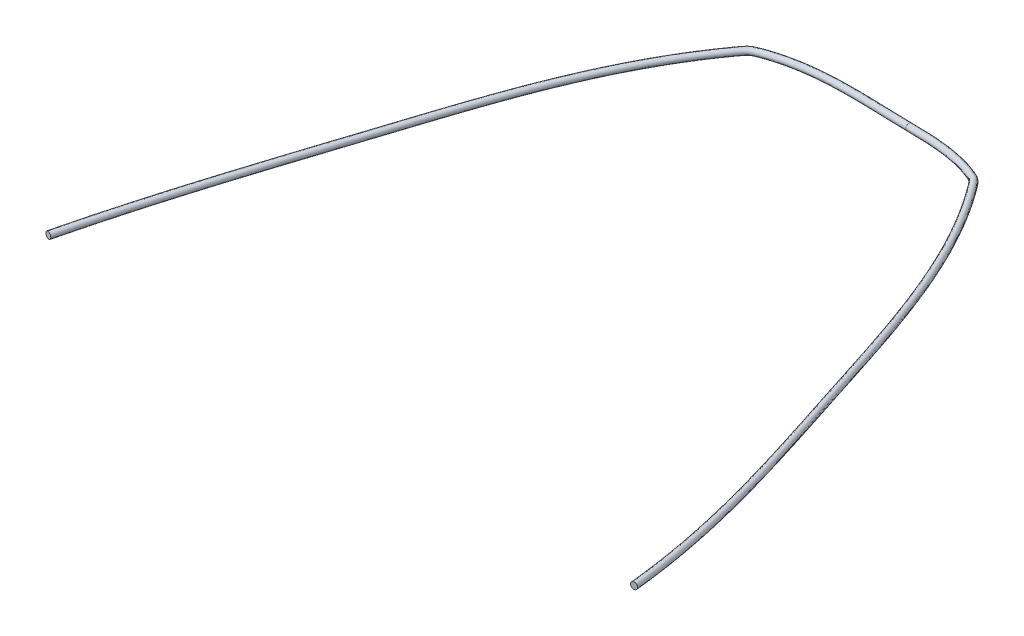
ISO-10303-21;
HEADER;
FILE_DESCRIPTION(('STEP AP214'),'2;1');
FILE_NAME('part.step','',(''),(''),'','','');
FILE_SCHEMA(('AUTOMOTIVE_DESIGN { 1 0 10303 214 1 1 1 1 }'));
ENDSEC;
DATA;
#1=APPLICATION_CONTEXT('core data for automotive mechanical design processes');
#2=APPLICATION_PROTOCOL_DEFINITION('international standard','automotive_design',2000,#1);
#3=PRODUCT_CONTEXT('',#1,'mechanical');
#4=PRODUCT('Part','Part','',(#3));
#5=PRODUCT_RELATED_PRODUCT_CATEGORY('part','',(#4));
#6=PRODUCT_DEFINITION_FORMATION('','',#4);
#7=PRODUCT_DEFINITION_CONTEXT('part definition',#1,'design');
#8=PRODUCT_DEFINITION('design','',#6,#7);
#9=PRODUCT_DEFINITION_SHAPE('','',#8);
#10=(LENGTH_UNIT() NAMED_UNIT(*) SI_UNIT(.MILLI.,.METRE.));
#11=(NAMED_UNIT(*) PLANE_ANGLE_UNIT() SI_UNIT($,.RADIAN.));
#12=(NAMED_UNIT(*) SI_UNIT($,.STERADIAN.) SOLID_ANGLE_UNIT());
#13=UNCERTAINTY_MEASURE_WITH_UNIT(LENGTH_MEASURE(1.E-05),#10,'distance_accuracy_value','');
#14=(GEOMETRIC_REPRESENTATION_CONTEXT(3) GLOBAL_UNCERTAINTY_ASSIGNED_CONTEXT((#13)) GLOBAL_UNIT_ASSIGNED_CONTEXT((#10,
#11,#12)) REPRESENTATION_CONTEXT('',''));
#15=CARTESIAN_POINT('',(0.,0.,0.));
#16=DIRECTION('',(0.,0.,1.));
#17=DIRECTION('',(1.,0.,0.));
#18=AXIS2_PLACEMENT_3D('',#15,#16,#17);
#19=CARTESIAN_POINT('',(23.9109903196537,20.5189491781118,-56.2404113987804));
#20=DIRECTION('',(-0.999920794462454,0.,-0.0125858969316691));
#21=DIRECTION('',(-0.0125858969316691,0.,0.999920794462454));
#22=AXIS2_PLACEMENT_3D('',#19,#20,#21);
#23=PLANE('',#22);
#24=CARTESIAN_POINT('',(23.9109903196537,20.5189491781118,-56.2404113987804));
#25=DIRECTION('',(-0.999920794462454,0.,-0.0125858969316691));
#26=DIRECTION('',(-0.0125858969316691,0.,0.999920794462454));
#27=AXIS2_PLACEMENT_3D('',#24,#25,#26);
#28=CIRCLE('',#27,0.500000000000001);
#29=CARTESIAN_POINT('',(23.9046973711879,20.5189491781118,-55.7404510015492));
#30=VERTEX_POINT('',#29);
#31=EDGE_CURVE('E62',#30,#30,#28,.T.);
#32=ORIENTED_EDGE('',*,*,#31,.F.);
#33=EDGE_LOOP('',(#32));
#34=FACE_BOUND('',#33,.T.);
#35=ADVANCED_FACE('F55',(#34),#23,.F.);
#36=CARTESIAN_POINT('',(-27.8149271506802,20.5189491781118,24.3250485650167));
#37=DIRECTION('',(-0.235004549905539,0.,0.971994270314232));
#38=DIRECTION('',(0.971994270314232,0.,0.235004549905539));
#39=AXIS2_PLACEMENT_3D('',#36,#37,#38);
#40=PLANE('',#39);
#41=CARTESIAN_POINT('',(-27.8149271506802,20.5189491781118,24.3250485650167));
#42=DIRECTION('',(-0.235004549905539,0.,0.971994270314232));
#43=DIRECTION('',(0.971994270314232,0.,0.235004549905539));
#44=AXIS2_PLACEMENT_3D('',#41,#42,#43);
#45=CIRCLE('',#44,0.500000000000001);
#46=CARTESIAN_POINT('',(-27.3289300155231,20.5189491781118,24.4425508399694));
#47=VERTEX_POINT('',#46);
#48=EDGE_CURVE('E13',#47,#47,#45,.T.);
#49=ORIENTED_EDGE('',*,*,#48,.T.);
#50=EDGE_LOOP('',(#49));
#51=FACE_BOUND('',#50,.T.);
#52=ADVANCED_FACE('F69',(#51),#40,.T.);
#53=CARTESIAN_POINT('',(23.9046973711879,20.5189491781118,-55.7404510015492));
#54=CARTESIAN_POINT('',(16.7909939853175,20.5189491781118,-55.8299904376797));
#55=CARTESIAN_POINT('',(9.28930624325819,20.5189491781118,-56.6491466530552));
#56=CARTESIAN_POINT('',(2.39819858717068,20.5189491781118,-54.0107634379142));
#57=CARTESIAN_POINT('',(2.20770562805114,20.5189491781118,-53.9326611656841));
#58=CARTESIAN_POINT('',(1.8994808441903,20.5189491781118,-53.7560145318646));
#59=CARTESIAN_POINT('',(1.77184324666138,20.5189491781114,-53.6507161620611));
#60=CARTESIAN_POINT('',(1.37064679544783,20.5189491781125,-53.2362175975247));
#61=CARTESIAN_POINT('',(1.10261774425392,20.518949178111,-52.8461750883968));
#62=CARTESIAN_POINT('',(0.292477590110012,20.5189491781134,-51.7185053728503));
#63=CARTESIAN_POINT('',(-0.229768927800107,20.5189491781085,-50.9587760059153));
#64=CARTESIAN_POINT('',(-1.74664465949575,20.5189491781182,-48.6573448965568));
#65=CARTESIAN_POINT('',(-2.69141318632206,20.5189491781086,-47.093395675877));
#66=CARTESIAN_POINT('',(-5.35553842720182,20.5189491781181,-42.3255510794106));
#67=CARTESIAN_POINT('',(-6.90471111779322,20.5189491780991,-39.0455973348233));
#68=CARTESIAN_POINT('',(-11.1046895194555,20.518949178137,-29.0078923282297));
#69=CARTESIAN_POINT('',(-13.3073045807664,20.5189491780991,-22.0522056633679));
#70=CARTESIAN_POINT('',(-19.7611935258734,20.5189491781357,-2.00698699170944));
#71=CARTESIAN_POINT('',(-24.0655787488226,20.5189491781118,10.9451154322291));
#72=CARTESIAN_POINT('',(-27.3289300155231,20.5189491781118,24.4425508399694));
#73=CARTESIAN_POINT('',(23.9046973711879,21.5189491781118,-55.7404510015492));
#74=CARTESIAN_POINT('',(16.7909939853175,21.5189491781118,-55.8299904376797));
#75=CARTESIAN_POINT('',(9.28930624322013,21.5189491781118,-56.6491466530425));
#76=CARTESIAN_POINT('',(2.39819858717188,21.5189491781118,-54.0107634379146));
#77=CARTESIAN_POINT('',(2.20770562805114,21.5189491781118,-53.9326611656841));
#78=CARTESIAN_POINT('',(1.8994808441903,21.5189491781118,-53.7560145318646));
#79=CARTESIAN_POINT('',(1.77184324666138,21.5189491781114,-53.6507161620611));
#80=CARTESIAN_POINT('',(1.37064679544783,21.5189491781126,-53.2362175975247));
#81=CARTESIAN_POINT('',(1.10261774425392,21.518949178111,-52.8461750883968));
#82=CARTESIAN_POINT('',(0.292477590110012,21.5189491781134,-51.7185053728503));
#83=CARTESIAN_POINT('',(-0.229768927800107,21.5189491781086,-50.9587760059153));
#84=CARTESIAN_POINT('',(-1.74664465949575,21.5189491781182,-48.6573448965568));
#85=CARTESIAN_POINT('',(-2.69141318632206,21.5189491781086,-47.093395675877));
#86=CARTESIAN_POINT('',(-5.35553842720182,21.5189491781181,-42.3255510794106));
#87=CARTESIAN_POINT('',(-6.90471111779322,21.5189491780991,-39.0455973348359));
#88=CARTESIAN_POINT('',(-11.1046895194555,21.518949178137,-29.0078923282044));
#89=CARTESIAN_POINT('',(-13.3073045807664,21.5189491780991,-22.0522056633679));
#90=CARTESIAN_POINT('',(-19.7611935258734,21.5189491781357,-2.00698699170944));
#91=CARTESIAN_POINT('',(-24.0655787488226,21.5189491781118,10.9451154322291));
#92=CARTESIAN_POINT('',(-27.3289300155231,21.5189491781118,24.4425508399694));
#93=CARTESIAN_POINT('',(23.9172832681195,21.5189491781118,-56.7403717960117));
#94=CARTESIAN_POINT('',(16.8740491165269,21.5189491781118,-56.8290242432125));
#95=CARTESIAN_POINT('',(9.23019256747426,21.5189491781118,-57.6973023378857));
#96=CARTESIAN_POINT('',(2.03124362155027,21.5189491781118,-54.9410565754639));
#97=CARTESIAN_POINT('',(1.7930547260478,21.5189491781118,-54.8476068501916));
#98=CARTESIAN_POINT('',(1.3196555689936,21.5189491781118,-54.5762971127394));
#99=CARTESIAN_POINT('',(1.10142887823904,21.5189491781114,-54.3959230727837));
#100=CARTESIAN_POINT('',(0.555847872500207,21.5189491781126,-53.83225276715));
#101=CARTESIAN_POINT('',(0.294495084817295,21.518949178111,-53.4352296141346));
#102=CARTESIAN_POINT('',(-0.527704520826346,21.5189491781134,-52.2907738175943));
#103=CARTESIAN_POINT('',(-1.05755225795522,21.5189491781086,-51.5199752165184));
#104=CARTESIAN_POINT('',(-2.59594090581047,21.5189491781182,-49.1859043243022));
#105=CARTESIAN_POINT('',(-3.55332411608362,21.5189491781086,-47.6009614130698));
#106=CARTESIAN_POINT('',(-6.25060747775068,21.5189491781181,-42.7737754746418));
#107=CARTESIAN_POINT('',(-7.81564504019219,21.5189491780991,-39.4592366755524));
#108=CARTESIAN_POINT('',(-12.0503264426858,21.518949178137,-29.33859350797));
#109=CARTESIAN_POINT('',(-14.2601899706424,21.5189491780991,-22.3555539962108));
#110=CARTESIAN_POINT('',(-20.7111684649866,21.5189491781357,-2.31937493209364));
#111=CARTESIAN_POINT('',(-25.0247179807711,21.5189491781118,10.6569415988289));
#112=CARTESIAN_POINT('',(-28.3009242858374,21.5189491781118,24.2075462900639));
#113=CARTESIAN_POINT('',(23.9172832681195,20.5189491781118,-56.7403717960117));
#114=CARTESIAN_POINT('',(16.8740491165269,20.5189491781118,-56.8290242432125));
#115=CARTESIAN_POINT('',(9.23019256751232,20.5189491781118,-57.6973023379111));
#116=CARTESIAN_POINT('',(2.03124362154907,20.5189491781118,-54.9410565754631));
#117=CARTESIAN_POINT('',(1.79305472604781,20.5189491781118,-54.8476068501916));
#118=CARTESIAN_POINT('',(1.3196555689936,20.5189491781118,-54.5762971127394));
#119=CARTESIAN_POINT('',(1.10142887823904,20.5189491781114,-54.3959230727837));
#120=CARTESIAN_POINT('',(0.555847872500214,20.5189491781125,-53.83225276715));
#121=CARTESIAN_POINT('',(0.294495084817309,20.518949178111,-53.4352296141346));
#122=CARTESIAN_POINT('',(-0.527704520826332,20.5189491781134,-52.2907738175943));
#123=CARTESIAN_POINT('',(-1.05755225795522,20.5189491781085,-51.5199752165184));
#124=CARTESIAN_POINT('',(-2.59594090581047,20.5189491781182,-49.1859043243022));
#125=CARTESIAN_POINT('',(-3.55332411608362,20.5189491781086,-47.6009614130698));
#126=CARTESIAN_POINT('',(-6.25060747775068,20.5189491781181,-42.7737754746418));
#127=CARTESIAN_POINT('',(-7.81564504019219,20.5189491780991,-39.4592366755524));
#128=CARTESIAN_POINT('',(-12.0503264426858,20.518949178137,-29.33859350797));
#129=CARTESIAN_POINT('',(-14.2601899706424,20.5189491780991,-22.3555539962108));
#130=CARTESIAN_POINT('',(-20.7111684649866,20.5189491781357,-2.31937493209364));
#131=CARTESIAN_POINT('',(-25.0247179807711,20.5189491781118,10.6569415988289));
#132=CARTESIAN_POINT('',(-28.3009242858374,20.5189491781118,24.2075462900639));
#133=CARTESIAN_POINT('',(23.9172832681195,19.5189491781118,-56.7403717960117));
#134=CARTESIAN_POINT('',(16.8740491165269,19.5189491781118,-56.8290242432125));
#135=CARTESIAN_POINT('',(9.23019256755038,19.5189491781118,-57.6973023379364));
#136=CARTESIAN_POINT('',(2.03124362154787,19.5189491781118,-54.9410565754623));
#137=CARTESIAN_POINT('',(1.7930547260478,19.5189491781118,-54.8476068501916));
#138=CARTESIAN_POINT('',(1.3196555689936,19.5189491781118,-54.5762971127394));
#139=CARTESIAN_POINT('',(1.10142887823904,19.5189491781114,-54.3959230727837));
#140=CARTESIAN_POINT('',(0.555847872500207,19.5189491781125,-53.83225276715));
#141=CARTESIAN_POINT('',(0.294495084817295,19.518949178111,-53.4352296141346));
#142=CARTESIAN_POINT('',(-0.527704520826346,19.5189491781134,-52.2907738175943));
#143=CARTESIAN_POINT('',(-1.05755225795522,19.5189491781085,-51.5199752165184));
#144=CARTESIAN_POINT('',(-2.59594090581047,19.5189491781182,-49.1859043243022));
#145=CARTESIAN_POINT('',(-3.55332411608362,19.5189491781086,-47.6009614130698));
#146=CARTESIAN_POINT('',(-6.25060747775068,19.5189491781181,-42.7737754746418));
#147=CARTESIAN_POINT('',(-7.81564504019219,19.5189491780991,-39.4592366755524));
#148=CARTESIAN_POINT('',(-12.0503264426858,19.518949178137,-29.33859350797));
#149=CARTESIAN_POINT('',(-14.2601899706424,19.5189491780991,-22.3555539962108));
#150=CARTESIAN_POINT('',(-20.7111684649866,19.5189491781357,-2.31937493209364));
#151=CARTESIAN_POINT('',(-25.0247179807711,19.5189491781118,10.6569415988289));
#152=CARTESIAN_POINT('',(-28.3009242858374,19.5189491781118,24.2075462900639));
#153=CARTESIAN_POINT('',(23.9046973711879,19.5189491781118,-55.7404510015492));
#154=CARTESIAN_POINT('',(16.7909939853175,19.5189491781118,-55.8299904376797));
#155=CARTESIAN_POINT('',(9.28930624329625,19.5189491781118,-56.6491466530679));
#156=CARTESIAN_POINT('',(2.39819858716948,19.5189491781118,-54.0107634379138));
#157=CARTESIAN_POINT('',(2.20770562805114,19.5189491781118,-53.9326611656841));
#158=CARTESIAN_POINT('',(1.8994808441903,19.5189491781118,-53.7560145318646));
#159=CARTESIAN_POINT('',(1.77184324666138,19.5189491781114,-53.6507161620611));
#160=CARTESIAN_POINT('',(1.37064679544783,19.5189491781125,-53.2362175975247));
#161=CARTESIAN_POINT('',(1.10261774425392,19.518949178111,-52.8461750883968));
#162=CARTESIAN_POINT('',(0.292477590110012,19.5189491781134,-51.7185053728503));
#163=CARTESIAN_POINT('',(-0.229768927800107,19.5189491781085,-50.9587760059153));
#164=CARTESIAN_POINT('',(-1.74664465949575,19.5189491781182,-48.6573448965568));
#165=CARTESIAN_POINT('',(-2.69141318632206,19.5189491781086,-47.093395675877));
#166=CARTESIAN_POINT('',(-5.35553842720182,19.5189491781181,-42.3255510794106));
#167=CARTESIAN_POINT('',(-6.90471111779322,19.5189491780991,-39.0455973348107));
#168=CARTESIAN_POINT('',(-11.1046895194555,19.518949178137,-29.007892328255));
#169=CARTESIAN_POINT('',(-13.3073045807664,19.5189491780991,-22.0522056633679));
#170=CARTESIAN_POINT('',(-19.7611935258734,19.5189491781357,-2.00698699170944));
#171=CARTESIAN_POINT('',(-24.0655787488226,19.5189491781118,10.9451154322291));
#172=CARTESIAN_POINT('',(-27.3289300155231,19.5189491781118,24.4425508399694));
#173=CARTESIAN_POINT('',(23.9046973711879,20.5189491781118,-55.7404510015492));
#174=CARTESIAN_POINT('',(16.7909939853175,20.5189491781118,-55.8299904376797));
#175=CARTESIAN_POINT('',(9.28930624325819,20.5189491781118,-56.6491466530552));
#176=CARTESIAN_POINT('',(2.39819858717068,20.5189491781118,-54.0107634379142));
#177=CARTESIAN_POINT('',(2.20770562805114,20.5189491781118,-53.9326611656841));
#178=CARTESIAN_POINT('',(1.8994808441903,20.5189491781118,-53.7560145318646));
#179=CARTESIAN_POINT('',(1.77184324666138,20.5189491781114,-53.6507161620611));
#180=CARTESIAN_POINT('',(1.37064679544783,20.5189491781125,-53.2362175975247));
#181=CARTESIAN_POINT('',(1.10261774425392,20.518949178111,-52.8461750883968));
#182=CARTESIAN_POINT('',(0.292477590110012,20.5189491781134,-51.7185053728503));
#183=CARTESIAN_POINT('',(-0.229768927800107,20.5189491781085,-50.9587760059153));
#184=CARTESIAN_POINT('',(-1.74664465949575,20.5189491781182,-48.6573448965568));
#185=CARTESIAN_POINT('',(-2.69141318632206,20.5189491781086,-47.093395675877));
#186=CARTESIAN_POINT('',(-5.35553842720182,20.5189491781181,-42.3255510794106));
#187=CARTESIAN_POINT('',(-6.90471111779322,20.5189491780991,-39.0455973348233));
#188=CARTESIAN_POINT('',(-11.1046895194555,20.518949178137,-29.0078923282297));
#189=CARTESIAN_POINT('',(-13.3073045807664,20.5189491780991,-22.0522056633679));
#190=CARTESIAN_POINT('',(-19.7611935258734,20.5189491781357,-2.00698699170944));
#191=CARTESIAN_POINT('',(-24.0655787488226,20.5189491781118,10.9451154322291));
#192=CARTESIAN_POINT('',(-27.3289300155231,20.5189491781118,24.4425508399694));
#193=(BOUNDED_SURFACE() B_SPLINE_SURFACE(3,3,((#53,#54,#55,#56,#57,#58,#59,#60,#61,#62,#63,#64,
#65,#66,#67,#68,#69,#70,#71,#72),(#73,#74,#75,#76,#77,#78,#79,#80,#81,#82,#83,#84,#85,#86,#87,
#88,#89,#90,#91,#92),(#93,#94,#95,#96,#97,#98,#99,#100,#101,#102,#103,#104,#105,#106,#107,#108,
#109,#110,#111,#112),(#113,#114,#115,#116,#117,#118,#119,#120,#121,#122,#123,#124,#125,#126,
#127,#128,#129,#130,#131,#132),(#133,#134,#135,#136,#137,#138,#139,#140,#141,#142,#143,#144,
#145,#146,#147,#148,#149,#150,#151,#152),(#153,#154,#155,#156,#157,#158,#159,#160,#161,#162,
#163,#164,#165,#166,#167,#168,#169,#170,#171,#172),(#173,#174,#175,#176,#177,#178,#179,#180,
#181,#182,#183,#184,#185,#186,#187,#188,#189,#190,#191,#192)),.UNSPECIFIED.,.T.,.F.,
.F.) B_SPLINE_SURFACE_WITH_KNOTS((4,3,4),(4,2,2,2,2,2,2,2,2,4),(0.,0.5,1.),(0.,
0.203140581626132,0.209537548834428,0.215934516042723,0.228728450459313,0.254316319292494,
0.305492056958855,0.407843532291578,0.612546482957024,1.),
.UNSPECIFIED.) GEOMETRIC_REPRESENTATION_ITEM() RATIONAL_B_SPLINE_SURFACE(((1.,1.,1.,1.,1.,1.,1.,
1.,1.,1.,1.,1.,1.,1.,1.,1.,1.,1.,1.,1.),(0.333333333333333,0.333333333333333,0.333333333333333,
0.333333333333333,0.333333333333333,0.333333333333333,0.333333333333333,0.333333333333333,
0.333333333333333,0.333333333333333,0.333333333333333,0.333333333333333,0.333333333333333,
0.333333333333333,0.333333333333333,0.333333333333333,0.333333333333333,0.333333333333333,
0.333333333333333,0.333333333333333),(0.333333333333333,0.333333333333333,0.333333333333333,
0.333333333333333,0.333333333333333,0.333333333333333,0.333333333333333,0.333333333333333,
0.333333333333333,0.333333333333333,0.333333333333333,0.333333333333333,0.333333333333333,
0.333333333333333,0.333333333333333,0.333333333333333,0.333333333333333,0.333333333333333,
0.333333333333333,0.333333333333333),(1.,1.,1.,1.,1.,1.,1.,1.,1.,1.,1.,1.,1.,1.,1.,1.,1.,1.,1.,
1.),(0.333333333333333,0.333333333333333,0.333333333333333,0.333333333333333,0.333333333333333,
0.333333333333333,0.333333333333333,0.333333333333333,0.333333333333333,0.333333333333333,
0.333333333333333,0.333333333333333,0.333333333333333,0.333333333333333,0.333333333333333,
0.333333333333333,0.333333333333333,0.333333333333333,0.333333333333333,0.333333333333333),
(0.333333333333333,0.333333333333333,0.333333333333333,0.333333333333333,0.333333333333333,
0.333333333333333,0.333333333333333,0.333333333333333,0.333333333333333,0.333333333333333,
0.333333333333333,0.333333333333333,0.333333333333333,0.333333333333333,0.333333333333333,
0.333333333333333,0.333333333333333,0.333333333333333,0.333333333333333,0.333333333333333),(1.,
1.,1.,1.,1.,1.,1.,1.,1.,1.,1.,1.,1.,1.,1.,1.,1.,1.,1.,1.))) REPRESENTATION_ITEM('') SURFACE());
#194=ORIENTED_EDGE('',*,*,#48,.F.);
#195=EDGE_LOOP('',(#194));
#196=FACE_BOUND('',#195,.T.);
#197=ORIENTED_EDGE('',*,*,#31,.T.);
#198=EDGE_LOOP('',(#197));
#199=FACE_BOUND('',#198,.T.);
#200=ADVANCED_FACE('F71',(#196,#199),#193,.T.);
#201=CLOSED_SHELL('',(#35,#52,#200));
#202=MANIFOLD_SOLID_BREP('B2',#201);
#203=CARTESIAN_POINT('',(23.9109903196537,20.5189491781118,-56.2404113987804));
#204=DIRECTION('',(0.999989477719406,0.,0.00458742307512945));
#205=DIRECTION('',(0.00458742307512945,0.,-0.999989477719406));
#206=AXIS2_PLACEMENT_3D('',#203,#204,#205);
#207=PLANE('',#206);
#208=CARTESIAN_POINT('',(23.9109903196537,20.5189491781118,-56.2404113987804));
#209=DIRECTION('',(0.999989477719406,0.,0.00458742307512945));
#210=DIRECTION('',(0.00458742307512945,0.,-0.999989477719406));
#211=AXIS2_PLACEMENT_3D('',#208,#209,#210);
#212=CIRCLE('',#211,0.500000000000003);
#213=CARTESIAN_POINT('',(23.9132840311913,20.5189491781118,-56.7404061376401));
#214=VERTEX_POINT('',#213);
#215=EDGE_CURVE('E112',#214,#214,#212,.T.);
#216=ORIENTED_EDGE('',*,*,#215,.F.);
#217=EDGE_LOOP('',(#216));
#218=FACE_BOUND('',#217,.T.);
#219=ADVANCED_FACE('F105',(#218),#207,.F.);
#220=CARTESIAN_POINT('',(63.8507986274074,20.5189491781118,25.9720090423499));
#221=DIRECTION('',(0.102682375277231,0.,0.994714195036658));
#222=DIRECTION('',(0.994714195036658,0.,-0.102682375277231));
#223=AXIS2_PLACEMENT_3D('',#220,#221,#222);
#224=PLANE('',#223);
#225=CARTESIAN_POINT('',(63.8507986274074,20.5189491781118,25.9720090423499));
#226=DIRECTION('',(0.102682375277231,0.,0.994714195036658));
#227=DIRECTION('',(0.994714195036658,0.,-0.102682375277231));
#228=AXIS2_PLACEMENT_3D('',#225,#226,#227);
#229=CIRCLE('',#228,0.500000000000003);
#230=CARTESIAN_POINT('',(64.3481557249257,20.5189491781118,25.9206678547113));
#231=VERTEX_POINT('',#230);
#232=EDGE_CURVE('E53',#231,#231,#229,.T.);
#233=ORIENTED_EDGE('',*,*,#232,.T.);
#234=EDGE_LOOP('',(#233));
#235=FACE_BOUND('',#234,.T.);
#236=ADVANCED_FACE('F119',(#235),#224,.T.);
#237=CARTESIAN_POINT('',(23.9132840311913,20.5189491781118,-56.7404061376401));
#238=CARTESIAN_POINT('',(27.720703360249,20.5189491781315,-56.7229397163271));
#239=CARTESIAN_POINT('',(31.7115478955499,20.5189491781051,-56.5166536081214));
#240=CARTESIAN_POINT('',(35.5824363844855,20.5189491781122,-54.8791018515584));
#241=CARTESIAN_POINT('',(35.8218458315302,20.5189491781125,-54.7743604942022));
#242=CARTESIAN_POINT('',(36.2866910479659,20.518949178111,-54.4647746016221));
#243=CARTESIAN_POINT('',(36.4808734807627,20.5189491781118,-54.2804451761812));
#244=CARTESIAN_POINT('',(36.994215070931,20.5189491781118,-53.7095771871469));
#245=CARTESIAN_POINT('',(37.2536243272795,20.5189491781126,-53.3276532984797));
#246=CARTESIAN_POINT('',(38.0788710557441,20.5189491781101,-52.196081630952));
#247=CARTESIAN_POINT('',(38.6101552402182,20.5189491781102,-51.4329811281168));
#248=CARTESIAN_POINT('',(40.151263709861,20.518949178115,-49.1196209878933));
#249=CARTESIAN_POINT('',(41.1083404077224,20.5189491781086,-47.545308202105));
#250=CARTESIAN_POINT('',(43.7999322526,20.5189491781181,-42.7427694204649));
#251=CARTESIAN_POINT('',(45.3548186972527,20.5189491781181,-39.435012829915));
#252=CARTESIAN_POINT('',(49.5526914696193,20.5189491780992,-29.3236145329201));
#253=CARTESIAN_POINT('',(51.7296551529208,20.5189491781118,-22.3318615256723));
#254=CARTESIAN_POINT('',(58.2937778541302,20.5189491781118,-1.93585380769849));
#255=CARTESIAN_POINT('',(62.8410938894765,20.5189491781118,11.321319184227));
#256=CARTESIAN_POINT('',(64.3481557249257,20.5189491781118,25.9206678547113));
#257=CARTESIAN_POINT('',(23.9132840311913,21.5189491781118,-56.7404061376401));
#258=CARTESIAN_POINT('',(27.7207033602556,21.5189491781315,-56.7229397163271));
#259=CARTESIAN_POINT('',(31.7115478955232,21.5189491781051,-56.5166536081348));
#260=CARTESIAN_POINT('',(35.5824363844871,21.5189491781122,-54.8791018515576));
#261=CARTESIAN_POINT('',(35.8218458315306,21.5189491781125,-54.7743604942018));
#262=CARTESIAN_POINT('',(36.2866910479655,21.518949178111,-54.4647746016225));
#263=CARTESIAN_POINT('',(36.4808734807627,21.5189491781118,-54.2804451761812));
#264=CARTESIAN_POINT('',(36.9942150709309,21.5189491781118,-53.7095771871469));
#265=CARTESIAN_POINT('',(37.2536243272795,21.5189491781126,-53.3276532984797));
#266=CARTESIAN_POINT('',(38.0788710557441,21.5189491781102,-52.196081630952));
#267=CARTESIAN_POINT('',(38.6101552402182,21.5189491781102,-51.4329811281168));
#268=CARTESIAN_POINT('',(40.151263709861,21.518949178115,-49.1196209878933));
#269=CARTESIAN_POINT('',(41.1083404077224,21.5189491781086,-47.545308202105));
#270=CARTESIAN_POINT('',(43.7999322526,21.5189491781181,-42.7427694204649));
#271=CARTESIAN_POINT('',(45.3548186972527,21.5189491781181,-39.435012829915));
#272=CARTESIAN_POINT('',(49.5526914696193,21.5189491780992,-29.3236145329201));
#273=CARTESIAN_POINT('',(51.7296551529208,21.5189491781118,-22.3318615256723));
#274=CARTESIAN_POINT('',(58.2937778541302,21.5189491781118,-1.93585380769849));
#275=CARTESIAN_POINT('',(62.8410938894765,21.5189491781118,11.321319184227));
#276=CARTESIAN_POINT('',(64.3481557249257,21.5189491781118,25.9206678547113));
#277=CARTESIAN_POINT('',(23.9086966081161,21.5189491781118,-55.7404166599207));
#278=CARTESIAN_POINT('',(27.6820096443769,21.5189491781315,-55.7231067000877));
#279=CARTESIAN_POINT('',(31.5349229470701,21.5189491781051,-55.5055718382997));
#280=CARTESIAN_POINT('',(35.1801755316495,21.5189491781122,-53.9634737671102));
#281=CARTESIAN_POINT('',(35.3594018226613,21.5189491781125,-53.8808676639011));
#282=CARTESIAN_POINT('',(35.6405054689678,21.518949178111,-53.6936532313033));
#283=CARTESIAN_POINT('',(35.7748358157335,21.5189491781118,-53.5700487782391));
#284=CARTESIAN_POINT('',(36.1755538796908,21.5189491781118,-53.1244251750801));
#285=CARTESIAN_POINT('',(36.4499549354674,21.5189491781126,-52.732532714862));
#286=CARTESIAN_POINT('',(37.262332453989,21.5189491781102,-51.6186072043635));
#287=CARTESIAN_POINT('',(37.7855273967821,21.5189491781102,-50.8671389766872));
#288=CARTESIAN_POINT('',(39.3038049729251,21.518949178115,-48.5880503235427));
#289=CARTESIAN_POINT('',(40.2475838553969,21.5189491781086,-47.035740443477));
#290=CARTESIAN_POINT('',(42.9044315971863,21.5189491781181,-42.2951946801604));
#291=CARTESIAN_POINT('',(44.4430020004294,21.5189491781181,-39.0232728417241));
#292=CARTESIAN_POINT('',(48.6056166866288,21.5189491780992,-28.9968005469096));
#293=CARTESIAN_POINT('',(50.7758005211145,21.5189491781118,-22.0315260821056));
#294=CARTESIAN_POINT('',(57.3456510495434,21.5189491781118,-1.61772088912245));
#295=CARTESIAN_POINT('',(61.8611434807712,21.5189491781118,11.5670226688393));
#296=CARTESIAN_POINT('',(63.353441529889,21.5189491781118,26.0233502299885));
#297=CARTESIAN_POINT('',(23.9086966081161,20.5189491781118,-55.7404166599207));
#298=CARTESIAN_POINT('',(27.6820096443703,20.5189491781315,-55.7231067000877));
#299=CARTESIAN_POINT('',(31.5349229470968,20.5189491781051,-55.5055718382863));
#300=CARTESIAN_POINT('',(35.1801755316479,20.5189491781122,-53.963473767111));
#301=CARTESIAN_POINT('',(35.3594018226605,20.5189491781125,-53.8808676639015));
#302=CARTESIAN_POINT('',(35.6405054689686,20.518949178111,-53.6936532313029));
#303=CARTESIAN_POINT('',(35.7748358157335,20.5189491781118,-53.5700487782391));
#304=CARTESIAN_POINT('',(36.1755538796908,20.5189491781118,-53.1244251750801));
#305=CARTESIAN_POINT('',(36.4499549354674,20.5189491781126,-52.732532714862));
#306=CARTESIAN_POINT('',(37.262332453989,20.5189491781101,-51.6186072043635));
#307=CARTESIAN_POINT('',(37.7855273967821,20.5189491781102,-50.8671389766872));
#308=CARTESIAN_POINT('',(39.3038049729251,20.518949178115,-48.5880503235427));
#309=CARTESIAN_POINT('',(40.2475838553969,20.5189491781086,-47.035740443477));
#310=CARTESIAN_POINT('',(42.9044315971863,20.5189491781181,-42.2951946801604));
#311=CARTESIAN_POINT('',(44.4430020004294,20.5189491781181,-39.0232728417304));
#312=CARTESIAN_POINT('',(48.6056166866288,20.5189491780992,-28.996800546897));
#313=CARTESIAN_POINT('',(50.7758005211145,20.5189491781118,-22.0315260821056));
#314=CARTESIAN_POINT('',(57.3456510495434,20.5189491781118,-1.61772088912245));
#315=CARTESIAN_POINT('',(61.8611434807712,20.5189491781118,11.5670226688393));
#316=CARTESIAN_POINT('',(63.353441529889,20.5189491781118,26.0233502299885));
#317=CARTESIAN_POINT('',(23.9086966081161,19.5189491781118,-55.7404166599207));
#318=CARTESIAN_POINT('',(27.6820096443637,19.5189491781315,-55.7231067000877));
#319=CARTESIAN_POINT('',(31.5349229471236,19.5189491781051,-55.5055718382729));
#320=CARTESIAN_POINT('',(35.1801755316463,19.5189491781121,-53.9634737671118));
#321=CARTESIAN_POINT('',(35.3594018226597,19.5189491781125,-53.8808676639019));
#322=CARTESIAN_POINT('',(35.6405054689694,19.518949178111,-53.6936532313025));
#323=CARTESIAN_POINT('',(35.7748358157335,19.5189491781117,-53.5700487782391));
#324=CARTESIAN_POINT('',(36.1755538796908,19.5189491781117,-53.1244251750801));
#325=CARTESIAN_POINT('',(36.4499549354674,19.5189491781126,-52.732532714862));
#326=CARTESIAN_POINT('',(37.262332453989,19.5189491781101,-51.6186072043635));
#327=CARTESIAN_POINT('',(37.7855273967821,19.5189491781102,-50.8671389766872));
#328=CARTESIAN_POINT('',(39.3038049729251,19.5189491781149,-48.5880503235427));
#329=CARTESIAN_POINT('',(40.2475838553969,19.5189491781086,-47.035740443477));
#330=CARTESIAN_POINT('',(42.9044315971863,19.5189491781181,-42.2951946801604));
#331=CARTESIAN_POINT('',(44.4430020004294,19.5189491781181,-39.0232728417367));
#332=CARTESIAN_POINT('',(48.6056166866288,19.5189491780991,-28.9968005468844));
#333=CARTESIAN_POINT('',(50.7758005211145,19.5189491781118,-22.0315260821056));
#334=CARTESIAN_POINT('',(57.3456510495434,19.5189491781118,-1.61772088912245));
#335=CARTESIAN_POINT('',(61.8611434807712,19.5189491781118,11.5670226688393));
#336=CARTESIAN_POINT('',(63.353441529889,19.5189491781118,26.0233502299885));
#337=CARTESIAN_POINT('',(23.9132840311913,19.5189491781118,-56.7404061376401));
#338=CARTESIAN_POINT('',(27.7207033602425,19.5189491781315,-56.7229397163271));
#339=CARTESIAN_POINT('',(31.7115478955767,19.5189491781051,-56.5166536081081));
#340=CARTESIAN_POINT('',(35.5824363844839,19.5189491781121,-54.8791018515592));
#341=CARTESIAN_POINT('',(35.8218458315298,19.5189491781125,-54.7743604942025));
#342=CARTESIAN_POINT('',(36.2866910479663,19.518949178111,-54.4647746016217));
#343=CARTESIAN_POINT('',(36.4808734807627,19.5189491781117,-54.2804451761812));
#344=CARTESIAN_POINT('',(36.994215070931,19.5189491781117,-53.7095771871469));
#345=CARTESIAN_POINT('',(37.2536243272795,19.5189491781126,-53.3276532984797));
#346=CARTESIAN_POINT('',(38.0788710557441,19.5189491781101,-52.196081630952));
#347=CARTESIAN_POINT('',(38.6101552402182,19.5189491781102,-51.4329811281168));
#348=CARTESIAN_POINT('',(40.151263709861,19.5189491781149,-49.1196209878933));
#349=CARTESIAN_POINT('',(41.1083404077224,19.5189491781086,-47.545308202105));
#350=CARTESIAN_POINT('',(43.7999322526,19.5189491781181,-42.7427694204649));
#351=CARTESIAN_POINT('',(45.3548186972527,19.5189491781181,-39.435012829915));
#352=CARTESIAN_POINT('',(49.5526914696193,19.5189491780991,-29.3236145329201));
#353=CARTESIAN_POINT('',(51.7296551529208,19.5189491781118,-22.3318615256723));
#354=CARTESIAN_POINT('',(58.2937778541302,19.5189491781118,-1.93585380769849));
#355=CARTESIAN_POINT('',(62.8410938894765,19.5189491781118,11.321319184227));
#356=CARTESIAN_POINT('',(64.3481557249257,19.5189491781118,25.9206678547113));
#357=CARTESIAN_POINT('',(23.9132840311913,20.5189491781118,-56.7404061376401));
#358=CARTESIAN_POINT('',(27.720703360249,20.5189491781315,-56.7229397163271));
#359=CARTESIAN_POINT('',(31.7115478955499,20.5189491781051,-56.5166536081214));
#360=CARTESIAN_POINT('',(35.5824363844855,20.5189491781122,-54.8791018515584));
#361=CARTESIAN_POINT('',(35.8218458315302,20.5189491781125,-54.7743604942022));
#362=CARTESIAN_POINT('',(36.2866910479659,20.518949178111,-54.4647746016221));
#363=CARTESIAN_POINT('',(36.4808734807627,20.5189491781118,-54.2804451761812));
#364=CARTESIAN_POINT('',(36.994215070931,20.5189491781118,-53.7095771871469));
#365=CARTESIAN_POINT('',(37.2536243272795,20.5189491781126,-53.3276532984797));
#366=CARTESIAN_POINT('',(38.0788710557441,20.5189491781101,-52.196081630952));
#367=CARTESIAN_POINT('',(38.6101552402182,20.5189491781102,-51.4329811281168));
#368=CARTESIAN_POINT('',(40.151263709861,20.518949178115,-49.1196209878933));
#369=CARTESIAN_POINT('',(41.1083404077224,20.5189491781086,-47.545308202105));
#370=CARTESIAN_POINT('',(43.7999322526,20.5189491781181,-42.7427694204649));
#371=CARTESIAN_POINT('',(45.3548186972527,20.5189491781181,-39.435012829915));
#372=CARTESIAN_POINT('',(49.5526914696193,20.5189491780992,-29.3236145329201));
#373=CARTESIAN_POINT('',(51.7296551529208,20.5189491781118,-22.3318615256723));
#374=CARTESIAN_POINT('',(58.2937778541302,20.5189491781118,-1.93585380769849));
#375=CARTESIAN_POINT('',(62.8410938894765,20.5189491781118,11.321319184227));
#376=CARTESIAN_POINT('',(64.3481557249257,20.5189491781118,25.9206678547113));
#377=(BOUNDED_SURFACE() B_SPLINE_SURFACE(3,3,((#237,#238,#239,#240,#241,#242,#243,#244,#245,
#246,#247,#248,#249,#250,#251,#252,#253,#254,#255,#256),(#257,#258,#259,#260,#261,#262,#263,
#264,#265,#266,#267,#268,#269,#270,#271,#272,#273,#274,#275,#276),(#277,#278,#279,#280,#281,
#282,#283,#284,#285,#286,#287,#288,#289,#290,#291,#292,#293,#294,#295,#296),(#297,#298,#299,
#300,#301,#302,#303,#304,#305,#306,#307,#308,#309,#310,#311,#312,#313,#314,#315,#316),(#317,
#318,#319,#320,#321,#322,#323,#324,#325,#326,#327,#328,#329,#330,#331,#332,#333,#334,#335,#336),
(#337,#338,#339,#340,#341,#342,#343,#344,#345,#346,#347,#348,#349,#350,#351,#352,#353,#354,#355,
#356),(#357,#358,#359,#360,#361,#362,#363,#364,#365,#366,#367,#368,#369,#370,#371,#372,#373,
#374,#375,#376)),.UNSPECIFIED.,.T.,.F.,.F.) B_SPLINE_SURFACE_WITH_KNOTS((4,3,4),(4,2,2,2,2,2,2,
2,2,4),(0.,0.5,1.),(0.,0.117441214733108,0.124415020445297,0.131388826157487,0.145336437581866,
0.173231660430623,0.229022106128138,0.340602997523168,0.563764780313229,1.),
.UNSPECIFIED.) GEOMETRIC_REPRESENTATION_ITEM() RATIONAL_B_SPLINE_SURFACE(((1.,1.,1.,1.,1.,1.,1.,
1.,1.,1.,1.,1.,1.,1.,1.,1.,1.,1.,1.,1.),(0.333333333333333,0.333333333333333,0.333333333333333,
0.333333333333333,0.333333333333333,0.333333333333333,0.333333333333333,0.333333333333333,
0.333333333333333,0.333333333333333,0.333333333333333,0.333333333333333,0.333333333333333,
0.333333333333333,0.333333333333333,0.333333333333333,0.333333333333333,0.333333333333333,
0.333333333333333,0.333333333333333),(0.333333333333333,0.333333333333333,0.333333333333333,
0.333333333333333,0.333333333333333,0.333333333333333,0.333333333333333,0.333333333333333,
0.333333333333333,0.333333333333333,0.333333333333333,0.333333333333333,0.333333333333333,
0.333333333333333,0.333333333333333,0.333333333333333,0.333333333333333,0.333333333333333,
0.333333333333333,0.333333333333333),(1.,1.,1.,1.,1.,1.,1.,1.,1.,1.,1.,1.,1.,1.,1.,1.,1.,1.,1.,
1.),(0.333333333333333,0.333333333333333,0.333333333333333,0.333333333333333,0.333333333333333,
0.333333333333333,0.333333333333333,0.333333333333333,0.333333333333333,0.333333333333333,
0.333333333333333,0.333333333333333,0.333333333333333,0.333333333333333,0.333333333333333,
0.333333333333333,0.333333333333333,0.333333333333333,0.333333333333333,0.333333333333333),
(0.333333333333333,0.333333333333333,0.333333333333333,0.333333333333333,0.333333333333333,
0.333333333333333,0.333333333333333,0.333333333333333,0.333333333333333,0.333333333333333,
0.333333333333333,0.333333333333333,0.333333333333333,0.333333333333333,0.333333333333333,
0.333333333333333,0.333333333333333,0.333333333333333,0.333333333333333,0.333333333333333),(1.,
1.,1.,1.,1.,1.,1.,1.,1.,1.,1.,1.,1.,1.,1.,1.,1.,1.,1.,1.))) REPRESENTATION_ITEM('') SURFACE());
#378=ORIENTED_EDGE('',*,*,#232,.F.);
#379=EDGE_LOOP('',(#378));
#380=FACE_BOUND('',#379,.T.);
#381=ORIENTED_EDGE('',*,*,#215,.T.);
#382=EDGE_LOOP('',(#381));
#383=FACE_BOUND('',#382,.T.);
#384=ADVANCED_FACE('F121',(#380,#383),#377,.T.);
#385=CLOSED_SHELL('',(#219,#236,#384));
#386=MANIFOLD_SOLID_BREP('B7',#385);
#387=ADVANCED_BREP_SHAPE_REPRESENTATION('',(#18,#202,#386),#14);
#388=SHAPE_DEFINITION_REPRESENTATION(#9,#387);
ENDSEC;
END-ISO-10303-21;
